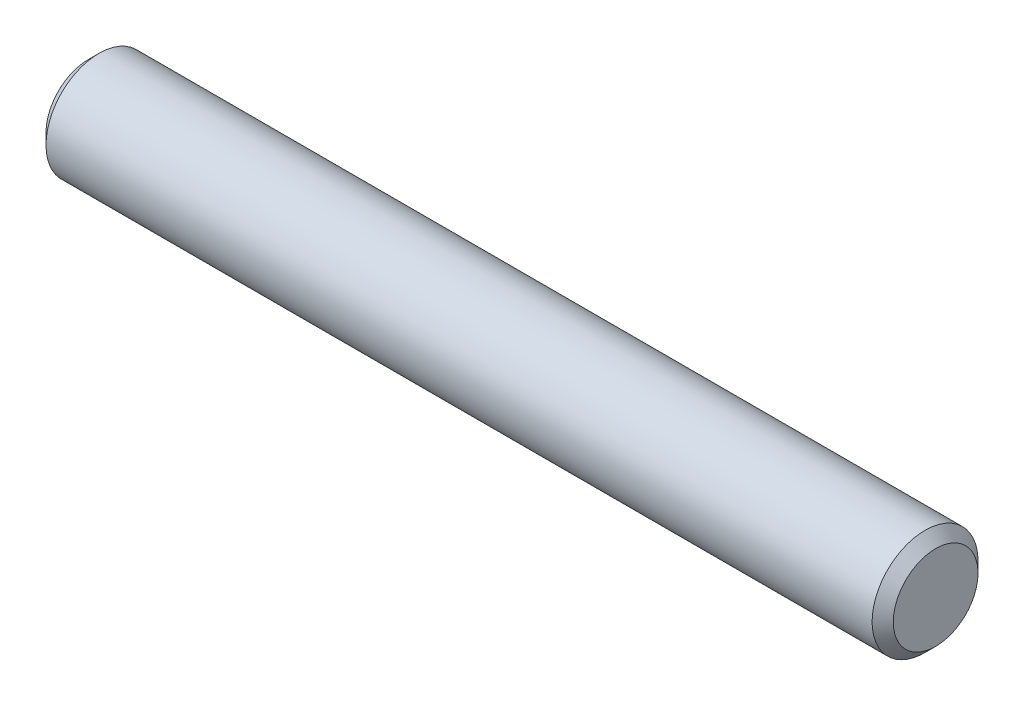
ISO-10303-21;
HEADER;
FILE_DESCRIPTION(('STEP AP214'),'2;1');
FILE_NAME('part.step','',(''),(''),'','','');
FILE_SCHEMA(('AUTOMOTIVE_DESIGN { 1 0 10303 214 1 1 1 1 }'));
ENDSEC;
DATA;
#1=APPLICATION_CONTEXT('core data for automotive mechanical design processes');
#2=APPLICATION_PROTOCOL_DEFINITION('international standard','automotive_design',2000,#1);
#3=PRODUCT_CONTEXT('',#1,'mechanical');
#4=PRODUCT('Part','Part','',(#3));
#5=PRODUCT_RELATED_PRODUCT_CATEGORY('part','',(#4));
#6=PRODUCT_DEFINITION_FORMATION('','',#4);
#7=PRODUCT_DEFINITION_CONTEXT('part definition',#1,'design');
#8=PRODUCT_DEFINITION('design','',#6,#7);
#9=PRODUCT_DEFINITION_SHAPE('','',#8);
#10=(LENGTH_UNIT() NAMED_UNIT(*) SI_UNIT(.MILLI.,.METRE.));
#11=(NAMED_UNIT(*) PLANE_ANGLE_UNIT() SI_UNIT($,.RADIAN.));
#12=(NAMED_UNIT(*) SI_UNIT($,.STERADIAN.) SOLID_ANGLE_UNIT());
#13=UNCERTAINTY_MEASURE_WITH_UNIT(LENGTH_MEASURE(1.E-05),#10,'distance_accuracy_value','');
#14=(GEOMETRIC_REPRESENTATION_CONTEXT(3) GLOBAL_UNCERTAINTY_ASSIGNED_CONTEXT((#13)) GLOBAL_UNIT_ASSIGNED_CONTEXT((#10,
#11,#12)) REPRESENTATION_CONTEXT('',''));
#15=CARTESIAN_POINT('',(0.,0.,0.));
#16=DIRECTION('',(0.,0.,1.));
#17=DIRECTION('',(1.,0.,0.));
#18=AXIS2_PLACEMENT_3D('',#15,#16,#17);
#19=CARTESIAN_POINT('',(-6.35,0.,0.));
#20=DIRECTION('',(1.,0.,0.));
#21=DIRECTION('',(0.,0.,1.));
#22=AXIS2_PLACEMENT_3D('',#19,#20,#21);
#23=CYLINDRICAL_SURFACE('',#22,0.79375);
#24=CARTESIAN_POINT('',(6.19125,0.,0.));
#25=DIRECTION('',(-1.,0.,0.));
#26=DIRECTION('',(0.,0.,1.));
#27=AXIS2_PLACEMENT_3D('',#24,#25,#26);
#28=CIRCLE('',#27,0.79375);
#29=CARTESIAN_POINT('',(6.19125,0.,0.79375));
#30=VERTEX_POINT('',#29);
#31=EDGE_CURVE('E37',#30,#30,#28,.F.);
#32=ORIENTED_EDGE('',*,*,#31,.F.);
#33=EDGE_LOOP('',(#32));
#34=FACE_BOUND('',#33,.T.);
#35=CARTESIAN_POINT('',(-6.19125,0.,0.));
#36=DIRECTION('',(-1.,0.,0.));
#37=DIRECTION('',(0.,0.,1.));
#38=AXIS2_PLACEMENT_3D('',#35,#36,#37);
#39=CIRCLE('',#38,0.79375);
#40=CARTESIAN_POINT('',(-6.19125,0.,0.79375));
#41=VERTEX_POINT('',#40);
#42=EDGE_CURVE('E41',#41,#41,#39,.T.);
#43=ORIENTED_EDGE('',*,*,#42,.F.);
#44=EDGE_LOOP('',(#43));
#45=FACE_BOUND('',#44,.T.);
#46=ADVANCED_FACE('F30',(#34,#45),#23,.T.);
#47=CARTESIAN_POINT('',(-6.35,0.,0.));
#48=DIRECTION('',(1.,0.,0.));
#49=DIRECTION('',(0.,0.,1.));
#50=AXIS2_PLACEMENT_3D('',#47,#48,#49);
#51=PLANE('',#50);
#52=CARTESIAN_POINT('',(-6.35,0.,0.));
#53=DIRECTION('',(-1.,0.,0.));
#54=DIRECTION('',(0.,0.,1.));
#55=AXIS2_PLACEMENT_3D('',#52,#53,#54);
#56=CIRCLE('',#55,0.634999999999997);
#57=CARTESIAN_POINT('',(-6.35,0.,0.634999999999997));
#58=VERTEX_POINT('',#57);
#59=EDGE_CURVE('E10',#58,#58,#56,.F.);
#60=ORIENTED_EDGE('',*,*,#59,.F.);
#61=EDGE_LOOP('',(#60));
#62=FACE_BOUND('',#61,.T.);
#63=ADVANCED_FACE('F55',(#62),#51,.F.);
#64=CARTESIAN_POINT('',(6.35,0.,0.));
#65=DIRECTION('',(1.,0.,0.));
#66=DIRECTION('',(0.,0.,1.));
#67=AXIS2_PLACEMENT_3D('',#64,#65,#66);
#68=PLANE('',#67);
#69=CARTESIAN_POINT('',(6.35,0.,0.));
#70=DIRECTION('',(-1.,0.,0.));
#71=DIRECTION('',(0.,0.,1.));
#72=AXIS2_PLACEMENT_3D('',#69,#70,#71);
#73=CIRCLE('',#72,0.635);
#74=CARTESIAN_POINT('',(6.35,0.,0.635));
#75=VERTEX_POINT('',#74);
#76=EDGE_CURVE('E45',#75,#75,#73,.T.);
#77=ORIENTED_EDGE('',*,*,#76,.F.);
#78=EDGE_LOOP('',(#77));
#79=FACE_BOUND('',#78,.T.);
#80=ADVANCED_FACE('F53',(#79),#68,.T.);
#81=CARTESIAN_POINT('',(6.35,0.,0.));
#82=DIRECTION('',(-1.,0.,0.));
#83=DIRECTION('',(0.,0.,-1.));
#84=AXIS2_PLACEMENT_3D('',#81,#82,#83);
#85=CONICAL_SURFACE('',#84,0.635,0.785398163397445);
#86=ORIENTED_EDGE('',*,*,#31,.T.);
#87=EDGE_LOOP('',(#86));
#88=FACE_BOUND('',#87,.T.);
#89=ORIENTED_EDGE('',*,*,#76,.T.);
#90=EDGE_LOOP('',(#89));
#91=FACE_BOUND('',#90,.T.);
#92=ADVANCED_FACE('F51',(#88,#91),#85,.T.);
#93=CARTESIAN_POINT('',(-6.19125,0.,0.));
#94=DIRECTION('',(1.,0.,0.));
#95=DIRECTION('',(0.,0.,1.));
#96=AXIS2_PLACEMENT_3D('',#93,#94,#95);
#97=CONICAL_SURFACE('',#96,0.79375,0.78539816339745);
#98=ORIENTED_EDGE('',*,*,#59,.T.);
#99=EDGE_LOOP('',(#98));
#100=FACE_BOUND('',#99,.T.);
#101=ORIENTED_EDGE('',*,*,#42,.T.);
#102=EDGE_LOOP('',(#101));
#103=FACE_BOUND('',#102,.T.);
#104=ADVANCED_FACE('F32',(#100,#103),#97,.T.);
#105=CLOSED_SHELL('',(#46,#63,#80,#92,#104));
#106=MANIFOLD_SOLID_BREP('B2',#105);
#107=ADVANCED_BREP_SHAPE_REPRESENTATION('',(#18,#106),#14);
#108=SHAPE_DEFINITION_REPRESENTATION(#9,#107);
ENDSEC;
END-ISO-10303-21;
